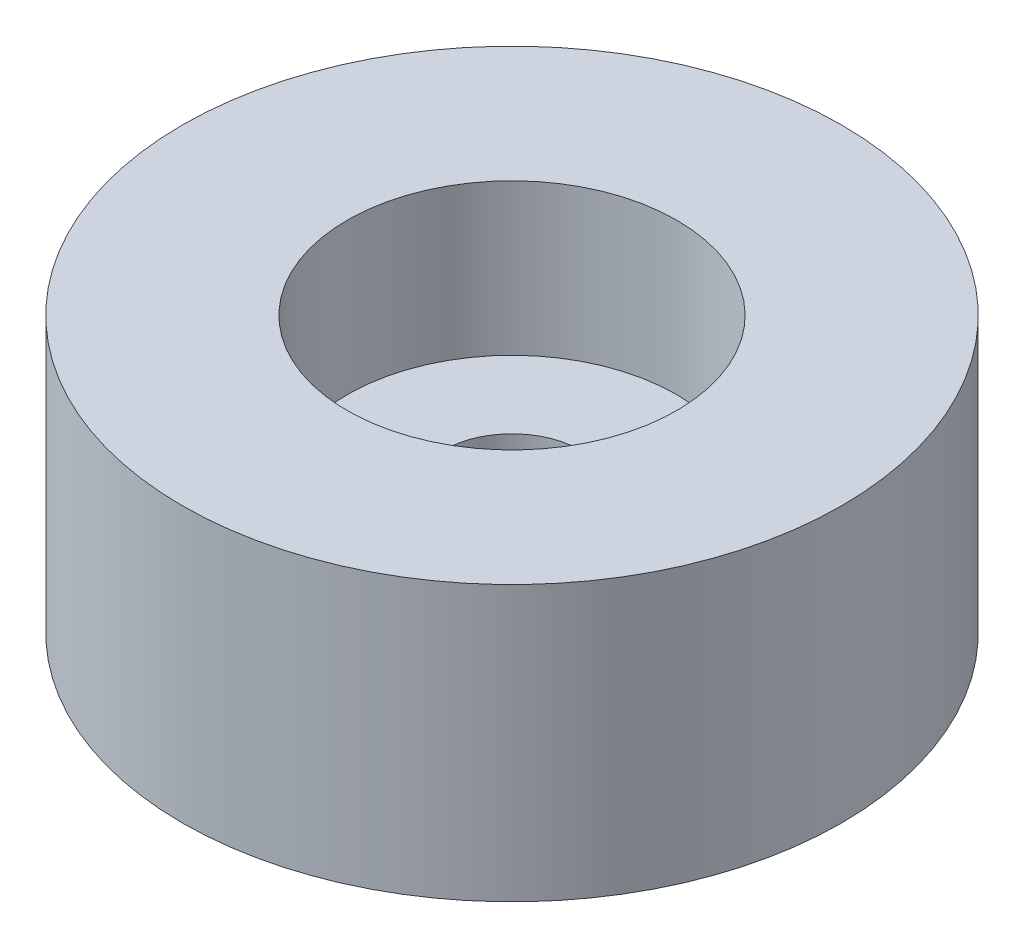
ISO-10303-21;
HEADER;
FILE_DESCRIPTION(('STEP AP214'),'2;1');
FILE_NAME('part.step','',(''),(''),'','','');
FILE_SCHEMA(('AUTOMOTIVE_DESIGN { 1 0 10303 214 1 1 1 1 }'));
ENDSEC;
DATA;
#1=APPLICATION_CONTEXT('core data for automotive mechanical design processes');
#2=APPLICATION_PROTOCOL_DEFINITION('international standard','automotive_design',2000,#1);
#3=PRODUCT_CONTEXT('',#1,'mechanical');
#4=PRODUCT('Part','Part','',(#3));
#5=PRODUCT_RELATED_PRODUCT_CATEGORY('part','',(#4));
#6=PRODUCT_DEFINITION_FORMATION('','',#4);
#7=PRODUCT_DEFINITION_CONTEXT('part definition',#1,'design');
#8=PRODUCT_DEFINITION('design','',#6,#7);
#9=PRODUCT_DEFINITION_SHAPE('','',#8);
#10=(LENGTH_UNIT() NAMED_UNIT(*) SI_UNIT(.MILLI.,.METRE.));
#11=(NAMED_UNIT(*) PLANE_ANGLE_UNIT() SI_UNIT($,.RADIAN.));
#12=(NAMED_UNIT(*) SI_UNIT($,.STERADIAN.) SOLID_ANGLE_UNIT());
#13=UNCERTAINTY_MEASURE_WITH_UNIT(LENGTH_MEASURE(1.E-05),#10,'distance_accuracy_value','');
#14=(GEOMETRIC_REPRESENTATION_CONTEXT(3) GLOBAL_UNCERTAINTY_ASSIGNED_CONTEXT((#13)) GLOBAL_UNIT_ASSIGNED_CONTEXT((#10,
#11,#12)) REPRESENTATION_CONTEXT('',''));
#15=CARTESIAN_POINT('',(0.,0.,0.));
#16=DIRECTION('',(0.,0.,1.));
#17=DIRECTION('',(1.,0.,0.));
#18=AXIS2_PLACEMENT_3D('',#15,#16,#17);
#19=CARTESIAN_POINT('',(0.,7.14375,0.));
#20=DIRECTION('',(0.,1.,0.));
#21=DIRECTION('',(0.,0.,1.));
#22=AXIS2_PLACEMENT_3D('',#19,#20,#21);
#23=PLANE('',#22);
#24=CARTESIAN_POINT('',(0.,7.14375,0.));
#25=DIRECTION('',(0.,-1.,0.));
#26=DIRECTION('',(0.,0.,-1.));
#27=AXIS2_PLACEMENT_3D('',#24,#25,#26);
#28=CIRCLE('',#27,3.96875);
#29=CARTESIAN_POINT('',(0.,7.14375,-3.96875));
#30=VERTEX_POINT('',#29);
#31=EDGE_CURVE('E11',#30,#30,#28,.T.);
#32=ORIENTED_EDGE('',*,*,#31,.T.);
#33=EDGE_LOOP('',(#32));
#34=FACE_BOUND('',#33,.T.);
#35=CARTESIAN_POINT('',(0.,7.14375,0.));
#36=DIRECTION('',(0.,-1.,0.));
#37=DIRECTION('',(0.,0.,-1.));
#38=AXIS2_PLACEMENT_3D('',#35,#36,#37);
#39=CIRCLE('',#38,9.525);
#40=CARTESIAN_POINT('',(0.,7.14375,-9.525));
#41=VERTEX_POINT('',#40);
#42=EDGE_CURVE('E59',#41,#41,#39,.T.);
#43=ORIENTED_EDGE('',*,*,#42,.F.);
#44=EDGE_LOOP('',(#43));
#45=FACE_BOUND('',#44,.T.);
#46=ADVANCED_FACE('F45',(#34,#45),#23,.T.);
#47=CARTESIAN_POINT('',(0.,0.,0.));
#48=DIRECTION('',(0.,-1.,0.));
#49=DIRECTION('',(0.,0.,-1.));
#50=AXIS2_PLACEMENT_3D('',#47,#48,#49);
#51=CYLINDRICAL_SURFACE('',#50,3.96875);
#52=CARTESIAN_POINT('',(0.,5.14375,0.));
#53=DIRECTION('',(0.,-1.,0.));
#54=DIRECTION('',(0.,0.,-1.));
#55=AXIS2_PLACEMENT_3D('',#52,#53,#54);
#56=CIRCLE('',#55,3.96875);
#57=CARTESIAN_POINT('',(0.,5.14375,-3.96875));
#58=VERTEX_POINT('',#57);
#59=EDGE_CURVE('E51',#58,#58,#56,.T.);
#60=ORIENTED_EDGE('',*,*,#59,.T.);
#61=EDGE_LOOP('',(#60));
#62=FACE_BOUND('',#61,.T.);
#63=ORIENTED_EDGE('',*,*,#31,.F.);
#64=EDGE_LOOP('',(#63));
#65=FACE_BOUND('',#64,.T.);
#66=ADVANCED_FACE('F69',(#62,#65),#51,.F.);
#67=CARTESIAN_POINT('',(0.,5.14375,0.));
#68=DIRECTION('',(0.,-1.,0.));
#69=DIRECTION('',(0.,0.,-1.));
#70=AXIS2_PLACEMENT_3D('',#67,#68,#69);
#71=PLANE('',#70);
#72=CARTESIAN_POINT('',(0.,5.14375,0.));
#73=DIRECTION('',(0.,-1.,0.));
#74=DIRECTION('',(0.,0.,-1.));
#75=AXIS2_PLACEMENT_3D('',#72,#73,#74);
#76=CIRCLE('',#75,9.525);
#77=CARTESIAN_POINT('',(0.,5.14375,-9.525));
#78=VERTEX_POINT('',#77);
#79=EDGE_CURVE('E55',#78,#78,#76,.T.);
#80=ORIENTED_EDGE('',*,*,#79,.T.);
#81=EDGE_LOOP('',(#80));
#82=FACE_BOUND('',#81,.T.);
#83=ORIENTED_EDGE('',*,*,#59,.F.);
#84=EDGE_LOOP('',(#83));
#85=FACE_BOUND('',#84,.T.);
#86=ADVANCED_FACE('F73',(#82,#85),#71,.T.);
#87=CARTESIAN_POINT('',(0.,0.,0.));
#88=DIRECTION('',(0.,-1.,0.));
#89=DIRECTION('',(0.,0.,-1.));
#90=AXIS2_PLACEMENT_3D('',#87,#88,#89);
#91=CYLINDRICAL_SURFACE('',#90,9.525);
#92=ORIENTED_EDGE('',*,*,#42,.T.);
#93=EDGE_LOOP('',(#92));
#94=FACE_BOUND('',#93,.T.);
#95=ORIENTED_EDGE('',*,*,#79,.F.);
#96=EDGE_LOOP('',(#95));
#97=FACE_BOUND('',#96,.T.);
#98=ADVANCED_FACE('F65',(#94,#97),#91,.T.);
#99=CLOSED_SHELL('',(#46,#66,#86,#98));
#100=MANIFOLD_SOLID_BREP('B2',#99);
#101=CARTESIAN_POINT('',(0.,0.,0.));
#102=DIRECTION('',(0.,1.,0.));
#103=DIRECTION('',(0.,0.,1.));
#104=AXIS2_PLACEMENT_3D('',#101,#102,#103);
#105=PLANE('',#104);
#106=CARTESIAN_POINT('',(0.,0.,0.));
#107=DIRECTION('',(0.,-1.,0.));
#108=DIRECTION('',(0.,0.,-1.));
#109=AXIS2_PLACEMENT_3D('',#106,#107,#108);
#110=CIRCLE('',#109,3.96875);
#111=CARTESIAN_POINT('',(0.,0.,-3.96875));
#112=VERTEX_POINT('',#111);
#113=EDGE_CURVE('E129',#112,#112,#110,.T.);
#114=ORIENTED_EDGE('',*,*,#113,.F.);
#115=EDGE_LOOP('',(#114));
#116=FACE_BOUND('',#115,.T.);
#117=CARTESIAN_POINT('',(0.,0.,0.));
#118=DIRECTION('',(0.,-1.,0.));
#119=DIRECTION('',(0.,0.,-1.));
#120=AXIS2_PLACEMENT_3D('',#117,#118,#119);
#121=CIRCLE('',#120,19.05);
#122=CARTESIAN_POINT('',(0.,0.,-19.05));
#123=VERTEX_POINT('',#122);
#124=EDGE_CURVE('E44',#123,#123,#121,.T.);
#125=ORIENTED_EDGE('',*,*,#124,.T.);
#126=EDGE_LOOP('',(#125));
#127=FACE_BOUND('',#126,.T.);
#128=ADVANCED_FACE('F107',(#116,#127),#105,.F.);
#129=CARTESIAN_POINT('',(0.,0.,0.));
#130=DIRECTION('',(0.,-1.,0.));
#131=DIRECTION('',(0.,0.,-1.));
#132=AXIS2_PLACEMENT_3D('',#129,#130,#131);
#133=CYLINDRICAL_SURFACE('',#132,19.05);
#134=ORIENTED_EDGE('',*,*,#124,.F.);
#135=EDGE_LOOP('',(#134));
#136=FACE_BOUND('',#135,.T.);
#137=CARTESIAN_POINT('',(0.,15.875,0.));
#138=DIRECTION('',(0.,-1.,0.));
#139=DIRECTION('',(0.,0.,-1.));
#140=AXIS2_PLACEMENT_3D('',#137,#138,#139);
#141=CIRCLE('',#140,19.05);
#142=CARTESIAN_POINT('',(0.,15.875,-19.05));
#143=VERTEX_POINT('',#142);
#144=EDGE_CURVE('E113',#143,#143,#141,.T.);
#145=ORIENTED_EDGE('',*,*,#144,.T.);
#146=EDGE_LOOP('',(#145));
#147=FACE_BOUND('',#146,.T.);
#148=ADVANCED_FACE('F136',(#136,#147),#133,.T.);
#149=CARTESIAN_POINT('',(0.,15.875,0.));
#150=DIRECTION('',(0.,-1.,0.));
#151=DIRECTION('',(0.,0.,-1.));
#152=AXIS2_PLACEMENT_3D('',#149,#150,#151);
#153=PLANE('',#152);
#154=ORIENTED_EDGE('',*,*,#144,.F.);
#155=EDGE_LOOP('',(#154));
#156=FACE_BOUND('',#155,.T.);
#157=CARTESIAN_POINT('',(0.,15.875,0.));
#158=DIRECTION('',(0.,-1.,0.));
#159=DIRECTION('',(0.,0.,-1.));
#160=AXIS2_PLACEMENT_3D('',#157,#158,#159);
#161=CIRCLE('',#160,9.525);
#162=CARTESIAN_POINT('',(0.,15.875,-9.525));
#163=VERTEX_POINT('',#162);
#164=EDGE_CURVE('E117',#163,#163,#161,.T.);
#165=ORIENTED_EDGE('',*,*,#164,.T.);
#166=EDGE_LOOP('',(#165));
#167=FACE_BOUND('',#166,.T.);
#168=ADVANCED_FACE('F140',(#156,#167),#153,.F.);
#169=CARTESIAN_POINT('',(0.,0.,0.));
#170=DIRECTION('',(0.,-1.,0.));
#171=DIRECTION('',(0.,0.,-1.));
#172=AXIS2_PLACEMENT_3D('',#169,#170,#171);
#173=CYLINDRICAL_SURFACE('',#172,9.525);
#174=ORIENTED_EDGE('',*,*,#164,.F.);
#175=EDGE_LOOP('',(#174));
#176=FACE_BOUND('',#175,.T.);
#177=CARTESIAN_POINT('',(0.,5.14375,0.));
#178=DIRECTION('',(0.,-1.,0.));
#179=DIRECTION('',(0.,0.,-1.));
#180=AXIS2_PLACEMENT_3D('',#177,#178,#179);
#181=CIRCLE('',#180,9.525);
#182=CARTESIAN_POINT('',(0.,5.14375,-9.525));
#183=VERTEX_POINT('',#182);
#184=EDGE_CURVE('E121',#183,#183,#181,.T.);
#185=ORIENTED_EDGE('',*,*,#184,.T.);
#186=EDGE_LOOP('',(#185));
#187=FACE_BOUND('',#186,.T.);
#188=ADVANCED_FACE('F145',(#176,#187),#173,.F.);
#189=CARTESIAN_POINT('',(0.,5.14375,0.));
#190=DIRECTION('',(0.,-1.,0.));
#191=DIRECTION('',(0.,0.,-1.));
#192=AXIS2_PLACEMENT_3D('',#189,#190,#191);
#193=PLANE('',#192);
#194=ORIENTED_EDGE('',*,*,#184,.F.);
#195=EDGE_LOOP('',(#194));
#196=FACE_BOUND('',#195,.T.);
#197=CARTESIAN_POINT('',(0.,5.14375,0.));
#198=DIRECTION('',(0.,-1.,0.));
#199=DIRECTION('',(0.,0.,-1.));
#200=AXIS2_PLACEMENT_3D('',#197,#198,#199);
#201=CIRCLE('',#200,3.96875);
#202=CARTESIAN_POINT('',(0.,5.14375,-3.96875));
#203=VERTEX_POINT('',#202);
#204=EDGE_CURVE('E126',#203,#203,#201,.T.);
#205=ORIENTED_EDGE('',*,*,#204,.T.);
#206=EDGE_LOOP('',(#205));
#207=FACE_BOUND('',#206,.T.);
#208=ADVANCED_FACE('F151',(#196,#207),#193,.F.);
#209=CARTESIAN_POINT('',(0.,0.,0.));
#210=DIRECTION('',(0.,-1.,0.));
#211=DIRECTION('',(0.,0.,-1.));
#212=AXIS2_PLACEMENT_3D('',#209,#210,#211);
#213=CYLINDRICAL_SURFACE('',#212,3.96875);
#214=ORIENTED_EDGE('',*,*,#204,.F.);
#215=EDGE_LOOP('',(#214));
#216=FACE_BOUND('',#215,.T.);
#217=ORIENTED_EDGE('',*,*,#113,.T.);
#218=EDGE_LOOP('',(#217));
#219=FACE_BOUND('',#218,.T.);
#220=ADVANCED_FACE('F133',(#216,#219),#213,.F.);
#221=CLOSED_SHELL('',(#128,#148,#168,#188,#208,#220));
#222=MANIFOLD_SOLID_BREP('B6',#221);
#223=ADVANCED_BREP_SHAPE_REPRESENTATION('',(#18,#100,#222),#14);
#224=SHAPE_DEFINITION_REPRESENTATION(#9,#223);
ENDSEC;
END-ISO-10303-21;
